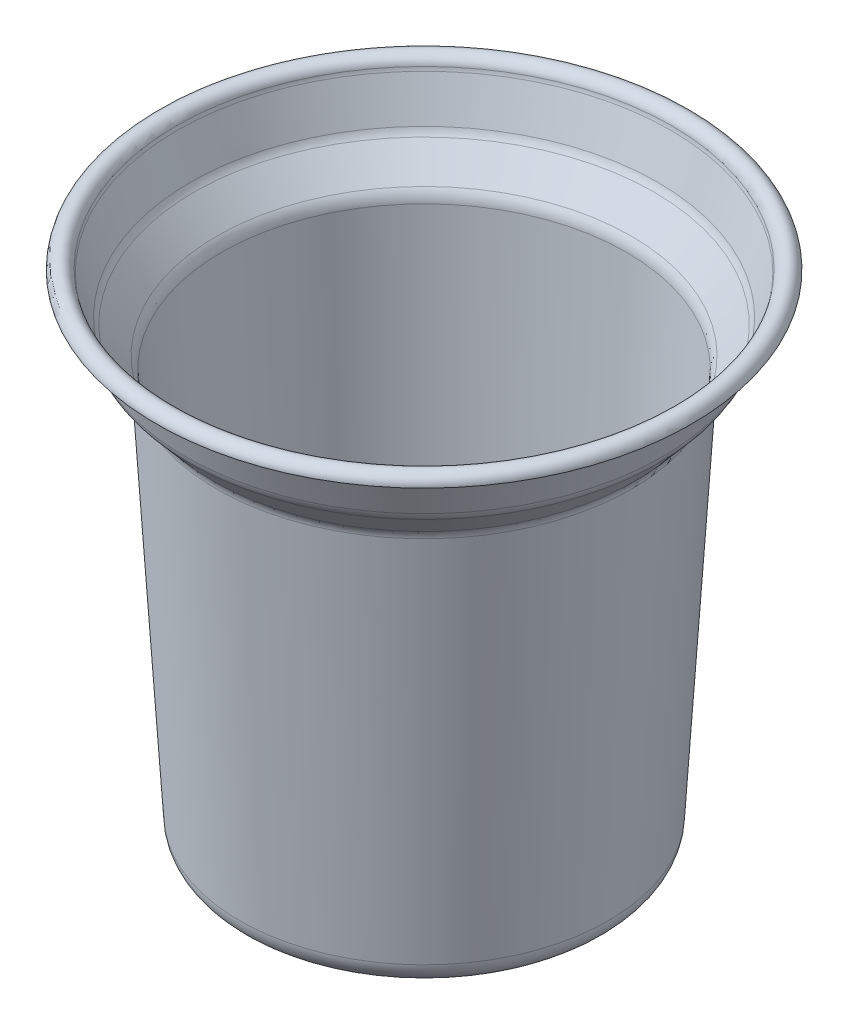
ISO-10303-21;
HEADER;
FILE_DESCRIPTION(('STEP AP214'),'2;1');
FILE_NAME('part.step','',(''),(''),'','','');
FILE_SCHEMA(('AUTOMOTIVE_DESIGN { 1 0 10303 214 1 1 1 1 }'));
ENDSEC;
DATA;
#1=APPLICATION_CONTEXT('core data for automotive mechanical design processes');
#2=APPLICATION_PROTOCOL_DEFINITION('international standard','automotive_design',2000,#1);
#3=PRODUCT_CONTEXT('',#1,'mechanical');
#4=PRODUCT('Part','Part','',(#3));
#5=PRODUCT_RELATED_PRODUCT_CATEGORY('part','',(#4));
#6=PRODUCT_DEFINITION_FORMATION('','',#4);
#7=PRODUCT_DEFINITION_CONTEXT('part definition',#1,'design');
#8=PRODUCT_DEFINITION('design','',#6,#7);
#9=PRODUCT_DEFINITION_SHAPE('','',#8);
#10=(LENGTH_UNIT() NAMED_UNIT(*) SI_UNIT(.MILLI.,.METRE.));
#11=(NAMED_UNIT(*) PLANE_ANGLE_UNIT() SI_UNIT($,.RADIAN.));
#12=(NAMED_UNIT(*) SI_UNIT($,.STERADIAN.) SOLID_ANGLE_UNIT());
#13=UNCERTAINTY_MEASURE_WITH_UNIT(LENGTH_MEASURE(1.E-05),#10,'distance_accuracy_value','');
#14=(GEOMETRIC_REPRESENTATION_CONTEXT(3) GLOBAL_UNCERTAINTY_ASSIGNED_CONTEXT((#13)) GLOBAL_UNIT_ASSIGNED_CONTEXT((#10,
#11,#12)) REPRESENTATION_CONTEXT('',''));
#15=CARTESIAN_POINT('',(0.,0.,0.));
#16=DIRECTION('',(0.,0.,1.));
#17=DIRECTION('',(1.,0.,0.));
#18=AXIS2_PLACEMENT_3D('',#15,#16,#17);
#19=CARTESIAN_POINT('',(0.,99.,0.));
#20=DIRECTION('',(0.,-1.,0.));
#21=DIRECTION('',(0.,0.,-1.));
#22=AXIS2_PLACEMENT_3D('',#19,#20,#21);
#23=TOROIDAL_SURFACE('',#22,52.,1.);
#24=CARTESIAN_POINT('',(0.,99.,0.));
#25=DIRECTION('',(0.,-1.,0.));
#26=DIRECTION('',(0.,0.,-1.));
#27=AXIS2_PLACEMENT_3D('',#24,#25,#26);
#28=CIRCLE('',#27,53.);
#29=CARTESIAN_POINT('',(0.,99.,-53.));
#30=VERTEX_POINT('',#29);
#31=EDGE_CURVE('E10',#30,#30,#28,.T.);
#32=ORIENTED_EDGE('',*,*,#31,.T.);
#33=EDGE_LOOP('',(#32));
#34=FACE_BOUND('',#33,.T.);
#35=CARTESIAN_POINT('',(0.,99.1360996485599,0.));
#36=DIRECTION('',(0.,-1.,0.));
#37=DIRECTION('',(0.,0.,-1.));
#38=AXIS2_PLACEMENT_3D('',#35,#36,#37);
#39=CIRCLE('',#38,51.0093048472603);
#40=CARTESIAN_POINT('',(0.,99.1360996485599,-51.0093048472603));
#41=VERTEX_POINT('',#40);
#42=EDGE_CURVE('E97',#41,#41,#39,.T.);
#43=ORIENTED_EDGE('',*,*,#42,.F.);
#44=EDGE_LOOP('',(#43));
#45=FACE_BOUND('',#44,.T.);
#46=ADVANCED_FACE('F39',(#34,#45),#23,.F.);
#47=CARTESIAN_POINT('',(54.,99.,0.));
#48=DIRECTION('',(0.,1.,0.));
#49=DIRECTION('',(0.,0.,1.));
#50=AXIS2_PLACEMENT_3D('',#47,#48,#49);
#51=PLANE('',#50);
#52=ORIENTED_EDGE('',*,*,#31,.F.);
#53=EDGE_LOOP('',(#52));
#54=FACE_BOUND('',#53,.T.);
#55=CARTESIAN_POINT('',(0.,99.,0.));
#56=DIRECTION('',(0.,-1.,0.));
#57=DIRECTION('',(0.,0.,-1.));
#58=AXIS2_PLACEMENT_3D('',#55,#56,#57);
#59=CIRCLE('',#58,54.);
#60=CARTESIAN_POINT('',(0.,99.,-54.));
#61=VERTEX_POINT('',#60);
#62=EDGE_CURVE('E45',#61,#61,#59,.T.);
#63=ORIENTED_EDGE('',*,*,#62,.T.);
#64=EDGE_LOOP('',(#63));
#65=FACE_BOUND('',#64,.T.);
#66=ADVANCED_FACE('F105',(#54,#65),#51,.F.);
#67=CARTESIAN_POINT('',(0.,99.,0.));
#68=DIRECTION('',(0.,-1.,0.));
#69=DIRECTION('',(0.,0.,-1.));
#70=AXIS2_PLACEMENT_3D('',#67,#68,#69);
#71=TOROIDAL_SURFACE('',#70,52.,2.);
#72=ORIENTED_EDGE('',*,*,#62,.F.);
#73=EDGE_LOOP('',(#72));
#74=FACE_BOUND('',#73,.T.);
#75=CARTESIAN_POINT('',(0.,99.2721992971199,0.));
#76=DIRECTION('',(0.,-1.,0.));
#77=DIRECTION('',(0.,0.,-1.));
#78=AXIS2_PLACEMENT_3D('',#75,#76,#77);
#79=CIRCLE('',#78,50.0186096945207);
#80=CARTESIAN_POINT('',(0.,99.2721992971199,-50.0186096945207));
#81=VERTEX_POINT('',#80);
#82=EDGE_CURVE('E49',#81,#81,#79,.T.);
#83=ORIENTED_EDGE('',*,*,#82,.T.);
#84=EDGE_LOOP('',(#83));
#85=FACE_BOUND('',#84,.T.);
#86=ADVANCED_FACE('F109',(#74,#85),#71,.T.);
#87=CARTESIAN_POINT('',(0.,99.8165978913596,0.));
#88=DIRECTION('',(0.,-1.,0.));
#89=DIRECTION('',(0.,0.,-1.));
#90=AXIS2_PLACEMENT_3D('',#87,#88,#89);
#91=TOROIDAL_SURFACE('',#90,46.055829083562,4.);
#92=ORIENTED_EDGE('',*,*,#82,.F.);
#93=EDGE_LOOP('',(#92));
#94=FACE_BOUND('',#93,.T.);
#95=CARTESIAN_POINT('',(0.,98.5516868272923,0.));
#96=DIRECTION('',(0.,-1.,0.));
#97=DIRECTION('',(0.,0.,-1.));
#98=AXIS2_PLACEMENT_3D('',#95,#96,#97);
#99=CIRCLE('',#98,49.8505622757641);
#100=CARTESIAN_POINT('',(0.,98.5516868272923,-49.8505622757641));
#101=VERTEX_POINT('',#100);
#102=EDGE_CURVE('E53',#101,#101,#99,.T.);
#103=ORIENTED_EDGE('',*,*,#102,.T.);
#104=EDGE_LOOP('',(#103));
#105=FACE_BOUND('',#104,.T.);
#106=ADVANCED_FACE('F114',(#94,#105),#91,.F.);
#107=CARTESIAN_POINT('',(0.,90.743339754369,0.));
#108=DIRECTION('',(0.,1.,0.));
#109=DIRECTION('',(0.,0.,1.));
#110=AXIS2_PLACEMENT_3D('',#107,#108,#109);
#111=CONICAL_SURFACE('',#110,47.247779918123,0.321750554396642);
#112=ORIENTED_EDGE('',*,*,#102,.F.);
#113=EDGE_LOOP('',(#112));
#114=FACE_BOUND('',#113,.T.);
#115=CARTESIAN_POINT('',(0.,90.743339754369,0.));
#116=DIRECTION('',(0.,-1.,0.));
#117=DIRECTION('',(0.,0.,-1.));
#118=AXIS2_PLACEMENT_3D('',#115,#116,#117);
#119=CIRCLE('',#118,47.247779918123);
#120=CARTESIAN_POINT('',(0.,90.743339754369,-47.247779918123));
#121=VERTEX_POINT('',#120);
#122=EDGE_CURVE('E58',#121,#121,#119,.T.);
#123=ORIENTED_EDGE('',*,*,#122,.T.);
#124=EDGE_LOOP('',(#123));
#125=FACE_BOUND('',#124,.T.);
#126=ADVANCED_FACE('F120',(#114,#125),#111,.F.);
#127=CARTESIAN_POINT('',(0.,92.0082508184364,0.));
#128=DIRECTION('',(0.,-1.,0.));
#129=DIRECTION('',(0.,0.,-1.));
#130=AXIS2_PLACEMENT_3D('',#127,#128,#129);
#131=TOROIDAL_SURFACE('',#130,43.4530467259209,4.);
#132=ORIENTED_EDGE('',*,*,#122,.F.);
#133=EDGE_LOOP('',(#132));
#134=FACE_BOUND('',#133,.T.);
#135=CARTESIAN_POINT('',(0.,89.4050853246125,0.));
#136=DIRECTION('',(0.,-1.,0.));
#137=DIRECTION('',(0.,0.,-1.));
#138=AXIS2_PLACEMENT_3D('',#135,#136,#137);
#139=CIRCLE('',#138,46.4900731353821);
#140=CARTESIAN_POINT('',(0.,89.4050853246125,-46.4900731353821));
#141=VERTEX_POINT('',#140);
#142=EDGE_CURVE('E61',#141,#141,#139,.T.);
#143=ORIENTED_EDGE('',*,*,#142,.T.);
#144=EDGE_LOOP('',(#143));
#145=FACE_BOUND('',#144,.T.);
#146=ADVANCED_FACE('F124',(#134,#145),#131,.F.);
#147=CARTESIAN_POINT('',(0.,84.0207125539737,0.));
#148=DIRECTION('',(0.,1.,0.));
#149=DIRECTION('',(0.,0.,1.));
#150=AXIS2_PLACEMENT_3D('',#147,#148,#149);
#151=CONICAL_SURFACE('',#150,41.8748964748346,0.708626272127671);
#152=ORIENTED_EDGE('',*,*,#142,.F.);
#153=EDGE_LOOP('',(#152));
#154=FACE_BOUND('',#153,.T.);
#155=CARTESIAN_POINT('',(0.,84.0207125539737,0.));
#156=DIRECTION('',(0.,-1.,0.));
#157=DIRECTION('',(0.,0.,-1.));
#158=AXIS2_PLACEMENT_3D('',#155,#156,#157);
#159=CIRCLE('',#158,41.8748964748346);
#160=CARTESIAN_POINT('',(0.,84.0207125539737,-41.8748964748346));
#161=VERTEX_POINT('',#160);
#162=EDGE_CURVE('E64',#161,#161,#159,.T.);
#163=ORIENTED_EDGE('',*,*,#162,.T.);
#164=EDGE_LOOP('',(#163));
#165=FACE_BOUND('',#164,.T.);
#166=ADVANCED_FACE('F128',(#154,#165),#151,.F.);
#167=CARTESIAN_POINT('',(0.,81.4175470601498,0.));
#168=DIRECTION('',(0.,-1.,0.));
#169=DIRECTION('',(0.,0.,-1.));
#170=AXIS2_PLACEMENT_3D('',#167,#168,#169);
#171=TOROIDAL_SURFACE('',#170,44.9119228842957,4.);
#172=ORIENTED_EDGE('',*,*,#162,.F.);
#173=EDGE_LOOP('',(#172));
#174=FACE_BOUND('',#173,.T.);
#175=CARTESIAN_POINT('',(0.,81.6580748762445,0.));
#176=DIRECTION('',(0.,-1.,0.));
#177=DIRECTION('',(0.,0.,-1.));
#178=AXIS2_PLACEMENT_3D('',#175,#176,#177);
#179=CIRCLE('',#178,40.9191611371232);
#180=CARTESIAN_POINT('',(0.,81.6580748762445,-40.9191611371232));
#181=VERTEX_POINT('',#180);
#182=EDGE_CURVE('E67',#181,#181,#179,.T.);
#183=ORIENTED_EDGE('',*,*,#182,.T.);
#184=EDGE_LOOP('',(#183));
#185=FACE_BOUND('',#184,.T.);
#186=ADVANCED_FACE('F132',(#174,#185),#171,.T.);
#187=CARTESIAN_POINT('',(0.,3.75947218390526,0.));
#188=DIRECTION('',(0.,1.,0.));
#189=DIRECTION('',(0.,0.,1.));
#190=AXIS2_PLACEMENT_3D('',#187,#188,#189);
#191=CONICAL_SURFACE('',#190,36.2264742279461,0.0601682511550097);
#192=ORIENTED_EDGE('',*,*,#182,.F.);
#193=EDGE_LOOP('',(#192));
#194=FACE_BOUND('',#193,.T.);
#195=CARTESIAN_POINT('',(0.,3.75947218390526,0.));
#196=DIRECTION('',(0.,-1.,0.));
#197=DIRECTION('',(0.,0.,-1.));
#198=AXIS2_PLACEMENT_3D('',#195,#196,#197);
#199=CIRCLE('',#198,36.2264742279461);
#200=CARTESIAN_POINT('',(0.,3.75947218390526,-36.2264742279461));
#201=VERTEX_POINT('',#200);
#202=EDGE_CURVE('E70',#201,#201,#199,.T.);
#203=ORIENTED_EDGE('',*,*,#202,.T.);
#204=EDGE_LOOP('',(#203));
#205=FACE_BOUND('',#204,.T.);
#206=ADVANCED_FACE('F136',(#194,#205),#191,.F.);
#207=CARTESIAN_POINT('',(0.,4.,0.));
#208=DIRECTION('',(0.,-1.,0.));
#209=DIRECTION('',(0.,0.,-1.));
#210=AXIS2_PLACEMENT_3D('',#207,#208,#209);
#211=TOROIDAL_SURFACE('',#210,32.2337124807735,4.);
#212=ORIENTED_EDGE('',*,*,#202,.F.);
#213=EDGE_LOOP('',(#212));
#214=FACE_BOUND('',#213,.T.);
#215=CARTESIAN_POINT('',(0.,0.,0.));
#216=DIRECTION('',(0.,-1.,0.));
#217=DIRECTION('',(0.,0.,-1.));
#218=AXIS2_PLACEMENT_3D('',#215,#216,#217);
#219=CIRCLE('',#218,32.2337124807735);
#220=CARTESIAN_POINT('',(0.,0.,-32.2337124807735));
#221=VERTEX_POINT('',#220);
#222=EDGE_CURVE('E73',#221,#221,#219,.T.);
#223=ORIENTED_EDGE('',*,*,#222,.T.);
#224=EDGE_LOOP('',(#223));
#225=FACE_BOUND('',#224,.T.);
#226=ADVANCED_FACE('F140',(#214,#225),#211,.F.);
#227=CARTESIAN_POINT('',(0.,0.,0.));
#228=DIRECTION('',(0.,-1.,0.));
#229=DIRECTION('',(0.,0.,-1.));
#230=AXIS2_PLACEMENT_3D('',#227,#228,#229);
#231=PLANE('',#230);
#232=ORIENTED_EDGE('',*,*,#222,.F.);
#233=EDGE_LOOP('',(#232));
#234=FACE_BOUND('',#233,.T.);
#235=ADVANCED_FACE('F144',(#234),#231,.F.);
#236=CARTESIAN_POINT('',(0.,-1.,0.));
#237=DIRECTION('',(0.,-1.,0.));
#238=DIRECTION('',(0.,0.,-1.));
#239=AXIS2_PLACEMENT_3D('',#236,#237,#238);
#240=PLANE('',#239);
#241=CARTESIAN_POINT('',(0.,-1.,0.));
#242=DIRECTION('',(0.,-1.,0.));
#243=DIRECTION('',(0.,0.,-1.));
#244=AXIS2_PLACEMENT_3D('',#241,#242,#243);
#245=CIRCLE('',#244,32.2337124807735);
#246=CARTESIAN_POINT('',(0.,-1.,-32.2337124807735));
#247=VERTEX_POINT('',#246);
#248=EDGE_CURVE('E76',#247,#247,#245,.T.);
#249=ORIENTED_EDGE('',*,*,#248,.T.);
#250=EDGE_LOOP('',(#249));
#251=FACE_BOUND('',#250,.T.);
#252=ADVANCED_FACE('F148',(#251),#240,.T.);
#253=CARTESIAN_POINT('',(0.,4.,0.));
#254=DIRECTION('',(0.,-1.,0.));
#255=DIRECTION('',(0.,0.,-1.));
#256=AXIS2_PLACEMENT_3D('',#253,#254,#255);
#257=TOROIDAL_SURFACE('',#256,32.2337124807735,5.);
#258=CARTESIAN_POINT('',(0.,3.69934022988158,0.));
#259=DIRECTION('',(0.,-1.,0.));
#260=DIRECTION('',(0.,0.,-1.));
#261=AXIS2_PLACEMENT_3D('',#258,#259,#260);
#262=CIRCLE('',#261,37.2246646647393);
#263=CARTESIAN_POINT('',(0.,3.69934022988158,-37.2246646647393));
#264=VERTEX_POINT('',#263);
#265=EDGE_CURVE('E79',#264,#264,#262,.T.);
#266=ORIENTED_EDGE('',*,*,#265,.T.);
#267=EDGE_LOOP('',(#266));
#268=FACE_BOUND('',#267,.T.);
#269=ORIENTED_EDGE('',*,*,#248,.F.);
#270=EDGE_LOOP('',(#269));
#271=FACE_BOUND('',#270,.T.);
#272=ADVANCED_FACE('F152',(#268,#271),#257,.T.);
#273=CARTESIAN_POINT('',(0.,3.69934022988158,0.));
#274=DIRECTION('',(0.,1.,0.));
#275=DIRECTION('',(0.,0.,1.));
#276=AXIS2_PLACEMENT_3D('',#273,#274,#275);
#277=CONICAL_SURFACE('',#276,37.2246646647393,0.0601682511550096);
#278=CARTESIAN_POINT('',(0.,81.5979429222208,0.));
#279=DIRECTION('',(0.,-1.,0.));
#280=DIRECTION('',(0.,0.,-1.));
#281=AXIS2_PLACEMENT_3D('',#278,#279,#280);
#282=CIRCLE('',#281,41.9173515739163);
#283=CARTESIAN_POINT('',(0.,81.5979429222208,-41.9173515739163));
#284=VERTEX_POINT('',#283);
#285=EDGE_CURVE('E82',#284,#284,#282,.T.);
#286=ORIENTED_EDGE('',*,*,#285,.T.);
#287=EDGE_LOOP('',(#286));
#288=FACE_BOUND('',#287,.T.);
#289=ORIENTED_EDGE('',*,*,#265,.F.);
#290=EDGE_LOOP('',(#289));
#291=FACE_BOUND('',#290,.T.);
#292=ADVANCED_FACE('F156',(#288,#291),#277,.T.);
#293=CARTESIAN_POINT('',(0.,81.4175470601498,0.));
#294=DIRECTION('',(0.,-1.,0.));
#295=DIRECTION('',(0.,0.,-1.));
#296=AXIS2_PLACEMENT_3D('',#293,#294,#295);
#297=TOROIDAL_SURFACE('',#296,44.9119228842957,3.);
#298=CARTESIAN_POINT('',(0.,83.3699211805177,0.));
#299=DIRECTION('',(0.,-1.,0.));
#300=DIRECTION('',(0.,0.,-1.));
#301=AXIS2_PLACEMENT_3D('',#298,#299,#300);
#302=CIRCLE('',#301,42.6341530771999);
#303=CARTESIAN_POINT('',(0.,83.3699211805177,-42.6341530771999));
#304=VERTEX_POINT('',#303);
#305=EDGE_CURVE('E85',#304,#304,#302,.T.);
#306=ORIENTED_EDGE('',*,*,#305,.T.);
#307=EDGE_LOOP('',(#306));
#308=FACE_BOUND('',#307,.T.);
#309=ORIENTED_EDGE('',*,*,#285,.F.);
#310=EDGE_LOOP('',(#309));
#311=FACE_BOUND('',#310,.T.);
#312=ADVANCED_FACE('F160',(#308,#311),#297,.F.);
#313=CARTESIAN_POINT('',(0.,83.3699211805177,0.));
#314=DIRECTION('',(0.,1.,0.));
#315=DIRECTION('',(0.,0.,1.));
#316=AXIS2_PLACEMENT_3D('',#313,#314,#315);
#317=CONICAL_SURFACE('',#316,42.6341530771999,0.708626272127671);
#318=CARTESIAN_POINT('',(0.,88.7542939511565,0.));
#319=DIRECTION('',(0.,-1.,0.));
#320=DIRECTION('',(0.,0.,-1.));
#321=AXIS2_PLACEMENT_3D('',#318,#319,#320);
#322=CIRCLE('',#321,47.2493297377474);
#323=CARTESIAN_POINT('',(0.,88.7542939511565,-47.2493297377474));
#324=VERTEX_POINT('',#323);
#325=EDGE_CURVE('E88',#324,#324,#322,.T.);
#326=ORIENTED_EDGE('',*,*,#325,.T.);
#327=EDGE_LOOP('',(#326));
#328=FACE_BOUND('',#327,.T.);
#329=ORIENTED_EDGE('',*,*,#305,.F.);
#330=EDGE_LOOP('',(#329));
#331=FACE_BOUND('',#330,.T.);
#332=ADVANCED_FACE('F164',(#328,#331),#317,.T.);
#333=CARTESIAN_POINT('',(0.,92.0082508184364,0.));
#334=DIRECTION('',(0.,-1.,0.));
#335=DIRECTION('',(0.,0.,-1.));
#336=AXIS2_PLACEMENT_3D('',#333,#334,#335);
#337=TOROIDAL_SURFACE('',#336,43.4530467259209,5.);
#338=CARTESIAN_POINT('',(0.,90.4271119883522,0.));
#339=DIRECTION('',(0.,-1.,0.));
#340=DIRECTION('',(0.,0.,-1.));
#341=AXIS2_PLACEMENT_3D('',#338,#339,#340);
#342=CIRCLE('',#341,48.1964632161735);
#343=CARTESIAN_POINT('',(0.,90.4271119883522,-48.1964632161735));
#344=VERTEX_POINT('',#343);
#345=EDGE_CURVE('E91',#344,#344,#342,.T.);
#346=ORIENTED_EDGE('',*,*,#345,.T.);
#347=EDGE_LOOP('',(#346));
#348=FACE_BOUND('',#347,.T.);
#349=ORIENTED_EDGE('',*,*,#325,.F.);
#350=EDGE_LOOP('',(#349));
#351=FACE_BOUND('',#350,.T.);
#352=ADVANCED_FACE('F168',(#348,#351),#337,.T.);
#353=CARTESIAN_POINT('',(0.,90.4271119883522,0.));
#354=DIRECTION('',(0.,1.,0.));
#355=DIRECTION('',(0.,0.,1.));
#356=AXIS2_PLACEMENT_3D('',#353,#354,#355);
#357=CONICAL_SURFACE('',#356,48.1964632161735,0.321750554396642);
#358=CARTESIAN_POINT('',(0.,98.2354590612754,0.));
#359=DIRECTION('',(0.,-1.,0.));
#360=DIRECTION('',(0.,0.,-1.));
#361=AXIS2_PLACEMENT_3D('',#358,#359,#360);
#362=CIRCLE('',#361,50.7992455738146);
#363=CARTESIAN_POINT('',(0.,98.2354590612754,-50.7992455738146));
#364=VERTEX_POINT('',#363);
#365=EDGE_CURVE('E94',#364,#364,#362,.T.);
#366=ORIENTED_EDGE('',*,*,#365,.T.);
#367=EDGE_LOOP('',(#366));
#368=FACE_BOUND('',#367,.T.);
#369=ORIENTED_EDGE('',*,*,#345,.F.);
#370=EDGE_LOOP('',(#369));
#371=FACE_BOUND('',#370,.T.);
#372=ADVANCED_FACE('F172',(#368,#371),#357,.T.);
#373=CARTESIAN_POINT('',(0.,99.8165978913596,0.));
#374=DIRECTION('',(0.,-1.,0.));
#375=DIRECTION('',(0.,0.,-1.));
#376=AXIS2_PLACEMENT_3D('',#373,#374,#375);
#377=TOROIDAL_SURFACE('',#376,46.055829083562,5.);
#378=ORIENTED_EDGE('',*,*,#42,.T.);
#379=EDGE_LOOP('',(#378));
#380=FACE_BOUND('',#379,.T.);
#381=ORIENTED_EDGE('',*,*,#365,.F.);
#382=EDGE_LOOP('',(#381));
#383=FACE_BOUND('',#382,.T.);
#384=ADVANCED_FACE('F101',(#380,#383),#377,.T.);
#385=CLOSED_SHELL('',(#46,#66,#86,#106,#126,#146,#166,#186,#206,#226,#235,#252,#272,#292,#312,
#332,#352,#372,#384));
#386=MANIFOLD_SOLID_BREP('B2',#385);
#387=ADVANCED_BREP_SHAPE_REPRESENTATION('',(#18,#386),#14);
#388=SHAPE_DEFINITION_REPRESENTATION(#9,#387);
ENDSEC;
END-ISO-10303-21;
